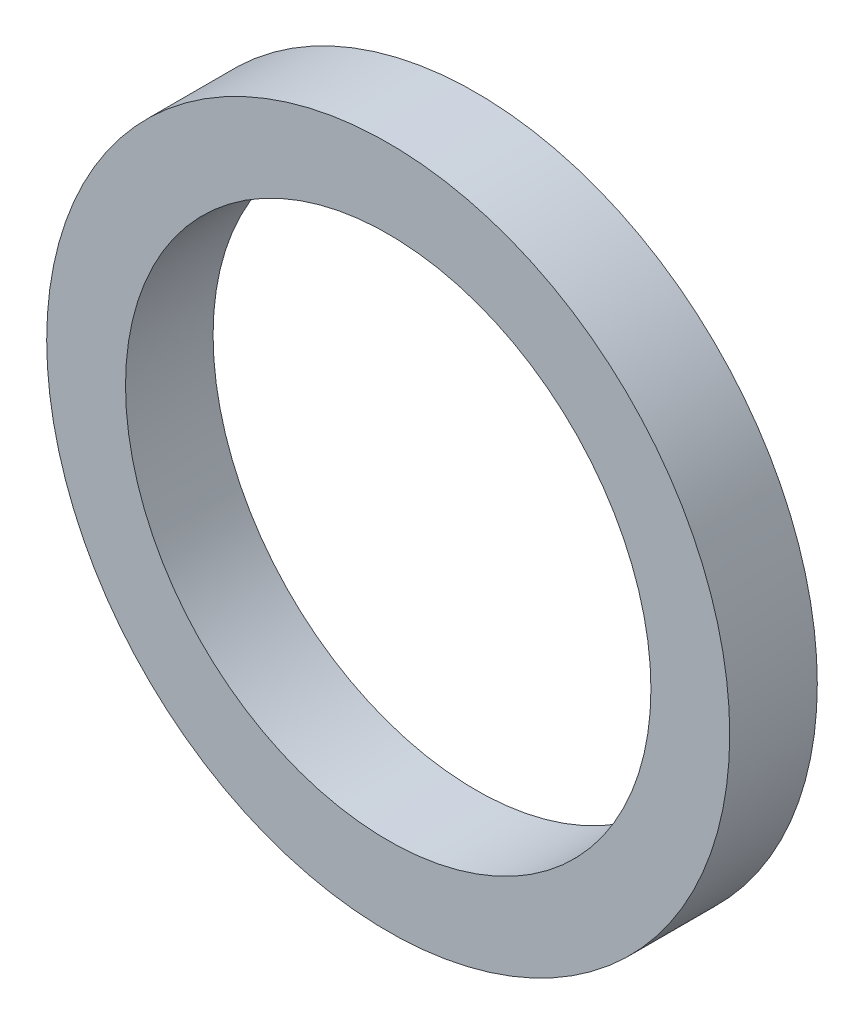
ISO-10303-21;
HEADER;
FILE_DESCRIPTION(('STEP AP214'),'2;1');
FILE_NAME('part.step','',(''),(''),'','','');
FILE_SCHEMA(('AUTOMOTIVE_DESIGN { 1 0 10303 214 1 1 1 1 }'));
ENDSEC;
DATA;
#1=APPLICATION_CONTEXT('core data for automotive mechanical design processes');
#2=APPLICATION_PROTOCOL_DEFINITION('international standard','automotive_design',2000,#1);
#3=PRODUCT_CONTEXT('',#1,'mechanical');
#4=PRODUCT('Part','Part','',(#3));
#5=PRODUCT_RELATED_PRODUCT_CATEGORY('part','',(#4));
#6=PRODUCT_DEFINITION_FORMATION('','',#4);
#7=PRODUCT_DEFINITION_CONTEXT('part definition',#1,'design');
#8=PRODUCT_DEFINITION('design','',#6,#7);
#9=PRODUCT_DEFINITION_SHAPE('','',#8);
#10=(LENGTH_UNIT() NAMED_UNIT(*) SI_UNIT(.MILLI.,.METRE.));
#11=(NAMED_UNIT(*) PLANE_ANGLE_UNIT() SI_UNIT($,.RADIAN.));
#12=(NAMED_UNIT(*) SI_UNIT($,.STERADIAN.) SOLID_ANGLE_UNIT());
#13=UNCERTAINTY_MEASURE_WITH_UNIT(LENGTH_MEASURE(1.E-05),#10,'distance_accuracy_value','');
#14=(GEOMETRIC_REPRESENTATION_CONTEXT(3) GLOBAL_UNCERTAINTY_ASSIGNED_CONTEXT((#13)) GLOBAL_UNIT_ASSIGNED_CONTEXT((#10,
#11,#12)) REPRESENTATION_CONTEXT('',''));
#15=CARTESIAN_POINT('',(0.,0.,0.));
#16=DIRECTION('',(0.,0.,1.));
#17=DIRECTION('',(1.,0.,0.));
#18=AXIS2_PLACEMENT_3D('',#15,#16,#17);
#19=CARTESIAN_POINT('',(0.,0.,10.));
#20=DIRECTION('',(0.,0.,1.));
#21=DIRECTION('',(1.,0.,0.));
#22=AXIS2_PLACEMENT_3D('',#19,#20,#21);
#23=PLANE('',#22);
#24=CARTESIAN_POINT('',(0.,0.,10.));
#25=DIRECTION('',(0.,0.,1.));
#26=DIRECTION('',(1.,0.,0.));
#27=AXIS2_PLACEMENT_3D('',#24,#25,#26);
#28=CIRCLE('',#27,39.);
#29=CARTESIAN_POINT('',(39.,0.,10.));
#30=VERTEX_POINT('',#29);
#31=EDGE_CURVE('E10',#30,#30,#28,.T.);
#32=ORIENTED_EDGE('',*,*,#31,.T.);
#33=EDGE_LOOP('',(#32));
#34=FACE_BOUND('',#33,.T.);
#35=CARTESIAN_POINT('',(0.,0.,10.));
#36=DIRECTION('',(0.,0.,1.));
#37=DIRECTION('',(1.,0.,0.));
#38=AXIS2_PLACEMENT_3D('',#35,#36,#37);
#39=CIRCLE('',#38,30.);
#40=CARTESIAN_POINT('',(30.,0.,10.));
#41=VERTEX_POINT('',#40);
#42=EDGE_CURVE('E41',#41,#41,#39,.T.);
#43=ORIENTED_EDGE('',*,*,#42,.F.);
#44=EDGE_LOOP('',(#43));
#45=FACE_BOUND('',#44,.T.);
#46=ADVANCED_FACE('F30',(#34,#45),#23,.T.);
#47=CARTESIAN_POINT('',(0.,0.,0.));
#48=DIRECTION('',(0.,0.,1.));
#49=DIRECTION('',(1.,0.,0.));
#50=AXIS2_PLACEMENT_3D('',#47,#48,#49);
#51=PLANE('',#50);
#52=CARTESIAN_POINT('',(0.,0.,0.));
#53=DIRECTION('',(0.,0.,1.));
#54=DIRECTION('',(1.,0.,0.));
#55=AXIS2_PLACEMENT_3D('',#52,#53,#54);
#56=CIRCLE('',#55,39.);
#57=CARTESIAN_POINT('',(39.,0.,0.));
#58=VERTEX_POINT('',#57);
#59=EDGE_CURVE('E34',#58,#58,#56,.T.);
#60=ORIENTED_EDGE('',*,*,#59,.F.);
#61=EDGE_LOOP('',(#60));
#62=FACE_BOUND('',#61,.T.);
#63=CARTESIAN_POINT('',(0.,0.,0.));
#64=DIRECTION('',(0.,0.,1.));
#65=DIRECTION('',(1.,0.,0.));
#66=AXIS2_PLACEMENT_3D('',#63,#64,#65);
#67=CIRCLE('',#66,30.);
#68=CARTESIAN_POINT('',(30.,0.,0.));
#69=VERTEX_POINT('',#68);
#70=EDGE_CURVE('E43',#69,#69,#67,.T.);
#71=ORIENTED_EDGE('',*,*,#70,.T.);
#72=EDGE_LOOP('',(#71));
#73=FACE_BOUND('',#72,.T.);
#74=ADVANCED_FACE('F53',(#62,#73),#51,.F.);
#75=CARTESIAN_POINT('',(0.,0.,10.));
#76=DIRECTION('',(0.,0.,-1.));
#77=DIRECTION('',(-1.,0.,0.));
#78=AXIS2_PLACEMENT_3D('',#75,#76,#77);
#79=CYLINDRICAL_SURFACE('',#78,39.);
#80=ORIENTED_EDGE('',*,*,#31,.F.);
#81=EDGE_LOOP('',(#80));
#82=FACE_BOUND('',#81,.T.);
#83=ORIENTED_EDGE('',*,*,#59,.T.);
#84=EDGE_LOOP('',(#83));
#85=FACE_BOUND('',#84,.T.);
#86=ADVANCED_FACE('F32',(#82,#85),#79,.T.);
#87=CARTESIAN_POINT('',(0.,0.,10.));
#88=DIRECTION('',(0.,0.,-1.));
#89=DIRECTION('',(-1.,0.,0.));
#90=AXIS2_PLACEMENT_3D('',#87,#88,#89);
#91=CYLINDRICAL_SURFACE('',#90,30.);
#92=ORIENTED_EDGE('',*,*,#42,.T.);
#93=EDGE_LOOP('',(#92));
#94=FACE_BOUND('',#93,.T.);
#95=ORIENTED_EDGE('',*,*,#70,.F.);
#96=EDGE_LOOP('',(#95));
#97=FACE_BOUND('',#96,.T.);
#98=ADVANCED_FACE('F49',(#94,#97),#91,.F.);
#99=CLOSED_SHELL('',(#46,#74,#86,#98));
#100=MANIFOLD_SOLID_BREP('B2',#99);
#101=ADVANCED_BREP_SHAPE_REPRESENTATION('',(#18,#100),#14);
#102=SHAPE_DEFINITION_REPRESENTATION(#9,#101);
ENDSEC;
END-ISO-10303-21;
